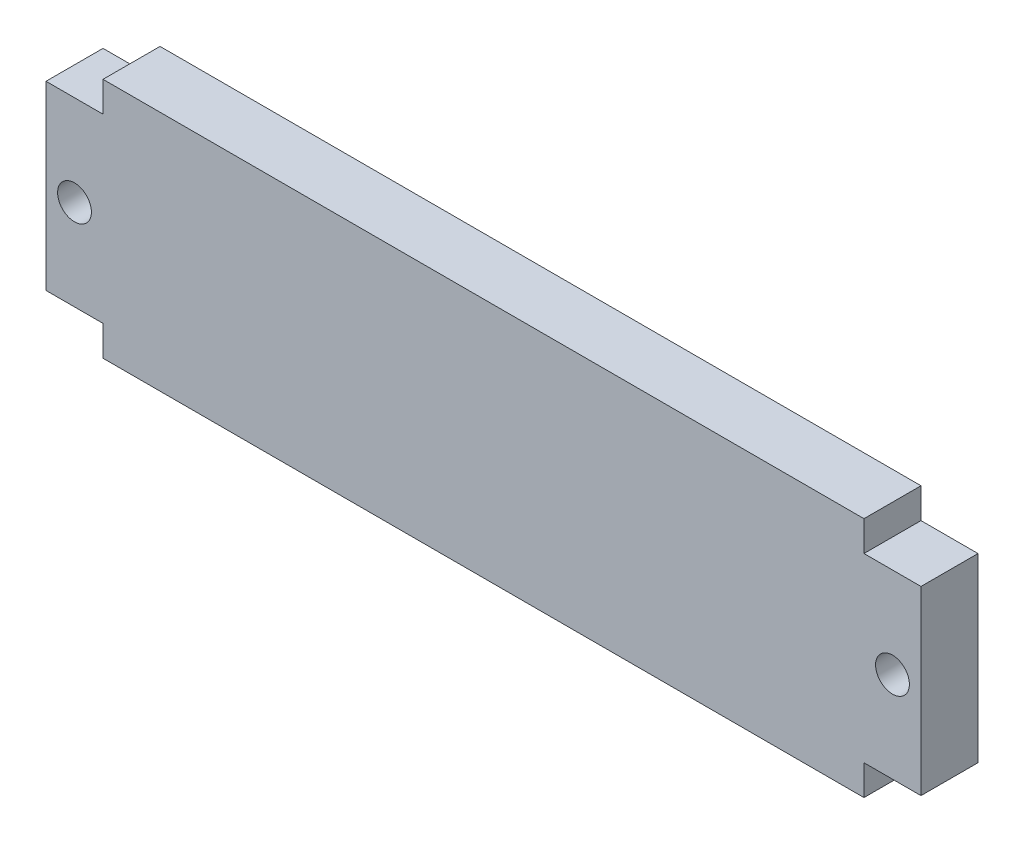
ISO-10303-21;
HEADER;
FILE_DESCRIPTION(('STEP AP214'),'2;1');
FILE_NAME('part.step','',(''),(''),'','','');
FILE_SCHEMA(('AUTOMOTIVE_DESIGN { 1 0 10303 214 1 1 1 1 }'));
ENDSEC;
DATA;
#1=APPLICATION_CONTEXT('core data for automotive mechanical design processes');
#2=APPLICATION_PROTOCOL_DEFINITION('international standard','automotive_design',2000,#1);
#3=PRODUCT_CONTEXT('',#1,'mechanical');
#4=PRODUCT('Part','Part','',(#3));
#5=PRODUCT_RELATED_PRODUCT_CATEGORY('part','',(#4));
#6=PRODUCT_DEFINITION_FORMATION('','',#4);
#7=PRODUCT_DEFINITION_CONTEXT('part definition',#1,'design');
#8=PRODUCT_DEFINITION('design','',#6,#7);
#9=PRODUCT_DEFINITION_SHAPE('','',#8);
#10=(LENGTH_UNIT() NAMED_UNIT(*) SI_UNIT(.MILLI.,.METRE.));
#11=(NAMED_UNIT(*) PLANE_ANGLE_UNIT() SI_UNIT($,.RADIAN.));
#12=(NAMED_UNIT(*) SI_UNIT($,.STERADIAN.) SOLID_ANGLE_UNIT());
#13=UNCERTAINTY_MEASURE_WITH_UNIT(LENGTH_MEASURE(1.E-05),#10,'distance_accuracy_value','');
#14=(GEOMETRIC_REPRESENTATION_CONTEXT(3) GLOBAL_UNCERTAINTY_ASSIGNED_CONTEXT((#13)) GLOBAL_UNIT_ASSIGNED_CONTEXT((#10,
#11,#12)) REPRESENTATION_CONTEXT('',''));
#15=CARTESIAN_POINT('',(0.,0.,0.));
#16=DIRECTION('',(0.,0.,1.));
#17=DIRECTION('',(1.,0.,0.));
#18=AXIS2_PLACEMENT_3D('',#15,#16,#17);
#19=CARTESIAN_POINT('',(0.,0.,-5.9944));
#20=DIRECTION('',(-1.,0.,0.));
#21=DIRECTION('',(0.,0.,1.));
#22=AXIS2_PLACEMENT_3D('',#19,#20,#21);
#23=PLANE('',#22);
#24=DIRECTION('',(0.,0.,1.));
#25=VECTOR('',#24,1.);
#26=CARTESIAN_POINT('',(0.,3.175,-5.9944));
#27=LINE('',#26,#25);
#28=CARTESIAN_POINT('',(0.,3.175,-5.9944));
#29=VERTEX_POINT('',#28);
#30=CARTESIAN_POINT('',(0.,3.175,0.));
#31=VERTEX_POINT('',#30);
#32=EDGE_CURVE('E211',#29,#31,#27,.T.);
#33=ORIENTED_EDGE('',*,*,#32,.T.);
#34=DIRECTION('',(0.,-1.,0.));
#35=VECTOR('',#34,1.);
#36=CARTESIAN_POINT('',(0.,0.,0.));
#37=LINE('',#36,#35);
#38=CARTESIAN_POINT('',(0.,22.225,0.));
#39=VERTEX_POINT('',#38);
#40=EDGE_CURVE('E158',#39,#31,#37,.T.);
#41=ORIENTED_EDGE('',*,*,#40,.F.);
#42=DIRECTION('',(0.,0.,1.));
#43=VECTOR('',#42,1.);
#44=CARTESIAN_POINT('',(0.,22.225,-5.9944));
#45=LINE('',#44,#43);
#46=CARTESIAN_POINT('',(0.,22.225,-5.9944));
#47=VERTEX_POINT('',#46);
#48=EDGE_CURVE('E181',#47,#39,#45,.T.);
#49=ORIENTED_EDGE('',*,*,#48,.F.);
#50=DIRECTION('',(0.,-1.,0.));
#51=VECTOR('',#50,1.);
#52=CARTESIAN_POINT('',(0.,0.,-5.9944));
#53=LINE('',#52,#51);
#54=EDGE_CURVE('E156',#47,#29,#53,.T.);
#55=ORIENTED_EDGE('',*,*,#54,.T.);
#56=EDGE_LOOP('',(#33,#41,#49,#55));
#57=FACE_BOUND('',#56,.T.);
#58=ADVANCED_FACE('F40',(#57),#23,.T.);
#59=CARTESIAN_POINT('',(0.,25.4,-5.9944));
#60=DIRECTION('',(0.,1.,0.));
#61=DIRECTION('',(0.,0.,1.));
#62=AXIS2_PLACEMENT_3D('',#59,#60,#61);
#63=PLANE('',#62);
#64=DIRECTION('',(0.,0.,1.));
#65=VECTOR('',#64,1.);
#66=CARTESIAN_POINT('',(86.0044,25.4,-5.9944));
#67=LINE('',#66,#65);
#68=CARTESIAN_POINT('',(86.0044,25.4,-5.9944));
#69=VERTEX_POINT('',#68);
#70=CARTESIAN_POINT('',(86.0044,25.4,0.));
#71=VERTEX_POINT('',#70);
#72=EDGE_CURVE('E56',#69,#71,#67,.T.);
#73=ORIENTED_EDGE('',*,*,#72,.F.);
#74=DIRECTION('',(-1.,0.,0.));
#75=VECTOR('',#74,1.);
#76=CARTESIAN_POINT('',(0.,25.4,-5.9944));
#77=LINE('',#76,#75);
#78=CARTESIAN_POINT('',(5.9944,25.4,-5.9944));
#79=VERTEX_POINT('',#78);
#80=EDGE_CURVE('E11',#69,#79,#77,.T.);
#81=ORIENTED_EDGE('',*,*,#80,.T.);
#82=DIRECTION('',(0.,0.,1.));
#83=VECTOR('',#82,1.);
#84=CARTESIAN_POINT('',(5.9944,25.4,-5.9944));
#85=LINE('',#84,#83);
#86=CARTESIAN_POINT('',(5.9944,25.4,0.));
#87=VERTEX_POINT('',#86);
#88=EDGE_CURVE('E173',#79,#87,#85,.T.);
#89=ORIENTED_EDGE('',*,*,#88,.T.);
#90=DIRECTION('',(-1.,0.,0.));
#91=VECTOR('',#90,1.);
#92=CARTESIAN_POINT('',(0.,25.4,0.));
#93=LINE('',#92,#91);
#94=EDGE_CURVE('E43',#71,#87,#93,.T.);
#95=ORIENTED_EDGE('',*,*,#94,.F.);
#96=EDGE_LOOP('',(#73,#81,#89,#95));
#97=FACE_BOUND('',#96,.T.);
#98=ADVANCED_FACE('F241',(#97),#63,.T.);
#99=CARTESIAN_POINT('',(91.9988,0.,-5.9944));
#100=DIRECTION('',(1.,0.,0.));
#101=DIRECTION('',(0.,0.,-1.));
#102=AXIS2_PLACEMENT_3D('',#99,#100,#101);
#103=PLANE('',#102);
#104=DIRECTION('',(0.,0.,1.));
#105=VECTOR('',#104,1.);
#106=CARTESIAN_POINT('',(91.9988,3.17499999999999,-5.9944));
#107=LINE('',#106,#105);
#108=CARTESIAN_POINT('',(91.9988,3.17499999999999,-5.9944));
#109=VERTEX_POINT('',#108);
#110=CARTESIAN_POINT('',(91.9988,3.17499999999999,0.));
#111=VERTEX_POINT('',#110);
#112=EDGE_CURVE('E64',#109,#111,#107,.T.);
#113=ORIENTED_EDGE('',*,*,#112,.F.);
#114=DIRECTION('',(0.,1.,0.));
#115=VECTOR('',#114,1.);
#116=CARTESIAN_POINT('',(91.9988,0.,-5.9944));
#117=LINE('',#116,#115);
#118=CARTESIAN_POINT('',(91.9988,22.225,-5.9944));
#119=VERTEX_POINT('',#118);
#120=EDGE_CURVE('E48',#109,#119,#117,.T.);
#121=ORIENTED_EDGE('',*,*,#120,.T.);
#122=DIRECTION('',(0.,0.,1.));
#123=VECTOR('',#122,1.);
#124=CARTESIAN_POINT('',(91.9988,22.225,-5.9944));
#125=LINE('',#124,#123);
#126=CARTESIAN_POINT('',(91.9988,22.225,0.));
#127=VERTEX_POINT('',#126);
#128=EDGE_CURVE('E135',#119,#127,#125,.T.);
#129=ORIENTED_EDGE('',*,*,#128,.T.);
#130=DIRECTION('',(0.,1.,0.));
#131=VECTOR('',#130,1.);
#132=CARTESIAN_POINT('',(91.9988,0.,0.));
#133=LINE('',#132,#131);
#134=EDGE_CURVE('E147',#111,#127,#133,.T.);
#135=ORIENTED_EDGE('',*,*,#134,.F.);
#136=EDGE_LOOP('',(#113,#121,#129,#135));
#137=FACE_BOUND('',#136,.T.);
#138=ADVANCED_FACE('F146',(#137),#103,.T.);
#139=CARTESIAN_POINT('',(0.,0.,-5.9944));
#140=DIRECTION('',(0.,-1.,0.));
#141=DIRECTION('',(0.,0.,-1.));
#142=AXIS2_PLACEMENT_3D('',#139,#140,#141);
#143=PLANE('',#142);
#144=DIRECTION('',(0.,0.,1.));
#145=VECTOR('',#144,1.);
#146=CARTESIAN_POINT('',(5.9944,0.,-5.9944));
#147=LINE('',#146,#145);
#148=CARTESIAN_POINT('',(5.9944,0.,-5.9944));
#149=VERTEX_POINT('',#148);
#150=CARTESIAN_POINT('',(5.9944,0.,0.));
#151=VERTEX_POINT('',#150);
#152=EDGE_CURVE('E205',#149,#151,#147,.T.);
#153=ORIENTED_EDGE('',*,*,#152,.F.);
#154=DIRECTION('',(1.,0.,0.));
#155=VECTOR('',#154,1.);
#156=CARTESIAN_POINT('',(0.,0.,-5.9944));
#157=LINE('',#156,#155);
#158=CARTESIAN_POINT('',(86.0044,0.,-5.9944));
#159=VERTEX_POINT('',#158);
#160=EDGE_CURVE('E164',#149,#159,#157,.T.);
#161=ORIENTED_EDGE('',*,*,#160,.T.);
#162=DIRECTION('',(0.,0.,1.));
#163=VECTOR('',#162,1.);
#164=CARTESIAN_POINT('',(86.0044,0.,-5.9944));
#165=LINE('',#164,#163);
#166=CARTESIAN_POINT('',(86.0044,0.,0.));
#167=VERTEX_POINT('',#166);
#168=EDGE_CURVE('E209',#159,#167,#165,.T.);
#169=ORIENTED_EDGE('',*,*,#168,.T.);
#170=DIRECTION('',(1.,0.,0.));
#171=VECTOR('',#170,1.);
#172=CARTESIAN_POINT('',(0.,0.,0.));
#173=LINE('',#172,#171);
#174=EDGE_CURVE('E154',#151,#167,#173,.T.);
#175=ORIENTED_EDGE('',*,*,#174,.F.);
#176=EDGE_LOOP('',(#153,#161,#169,#175));
#177=FACE_BOUND('',#176,.T.);
#178=ADVANCED_FACE('F267',(#177),#143,.T.);
#179=CARTESIAN_POINT('',(0.,0.,-5.9944));
#180=DIRECTION('',(0.,0.,-1.));
#181=DIRECTION('',(-1.,0.,0.));
#182=AXIS2_PLACEMENT_3D('',#179,#180,#181);
#183=PLANE('',#182);
#184=DIRECTION('',(-1.,0.,0.));
#185=VECTOR('',#184,1.);
#186=CARTESIAN_POINT('',(0.,3.175,-5.9944));
#187=LINE('',#186,#185);
#188=CARTESIAN_POINT('',(5.9944,3.175,-5.9944));
#189=VERTEX_POINT('',#188);
#190=EDGE_CURVE('E202',#189,#29,#187,.T.);
#191=ORIENTED_EDGE('',*,*,#190,.T.);
#192=ORIENTED_EDGE('',*,*,#54,.F.);
#193=DIRECTION('',(1.,0.,0.));
#194=VECTOR('',#193,1.);
#195=CARTESIAN_POINT('',(0.,22.225,-5.9944));
#196=LINE('',#195,#194);
#197=CARTESIAN_POINT('',(5.9944,22.225,-5.9944));
#198=VERTEX_POINT('',#197);
#199=EDGE_CURVE('E190',#47,#198,#196,.T.);
#200=ORIENTED_EDGE('',*,*,#199,.T.);
#201=DIRECTION('',(0.,1.,0.));
#202=VECTOR('',#201,1.);
#203=CARTESIAN_POINT('',(5.9944,25.4,-5.9944));
#204=LINE('',#203,#202);
#205=EDGE_CURVE('E184',#198,#79,#204,.T.);
#206=ORIENTED_EDGE('',*,*,#205,.T.);
#207=ORIENTED_EDGE('',*,*,#80,.F.);
#208=DIRECTION('',(0.,-1.,0.));
#209=VECTOR('',#208,1.);
#210=CARTESIAN_POINT('',(86.0044,25.4,-5.9944));
#211=LINE('',#210,#209);
#212=CARTESIAN_POINT('',(86.0044,22.225,-5.9944));
#213=VERTEX_POINT('',#212);
#214=EDGE_CURVE('E141',#69,#213,#211,.T.);
#215=ORIENTED_EDGE('',*,*,#214,.T.);
#216=DIRECTION('',(1.,0.,0.));
#217=VECTOR('',#216,1.);
#218=CARTESIAN_POINT('',(91.9988,22.225,-5.9944));
#219=LINE('',#218,#217);
#220=EDGE_CURVE('E233',#213,#119,#219,.T.);
#221=ORIENTED_EDGE('',*,*,#220,.T.);
#222=ORIENTED_EDGE('',*,*,#120,.F.);
#223=DIRECTION('',(-1.,0.,0.));
#224=VECTOR('',#223,1.);
#225=CARTESIAN_POINT('',(91.9988,3.17499999999999,-5.9944));
#226=LINE('',#225,#224);
#227=CARTESIAN_POINT('',(86.0044,3.17499999999999,-5.9944));
#228=VERTEX_POINT('',#227);
#229=EDGE_CURVE('E217',#109,#228,#226,.T.);
#230=ORIENTED_EDGE('',*,*,#229,.T.);
#231=DIRECTION('',(0.,-1.,0.));
#232=VECTOR('',#231,1.);
#233=CARTESIAN_POINT('',(86.0044,0.,-5.9944));
#234=LINE('',#233,#232);
#235=EDGE_CURVE('E221',#228,#159,#234,.T.);
#236=ORIENTED_EDGE('',*,*,#235,.T.);
#237=ORIENTED_EDGE('',*,*,#160,.F.);
#238=DIRECTION('',(0.,1.,0.));
#239=VECTOR('',#238,1.);
#240=CARTESIAN_POINT('',(5.9944,0.,-5.9944));
#241=LINE('',#240,#239);
#242=EDGE_CURVE('E198',#149,#189,#241,.T.);
#243=ORIENTED_EDGE('',*,*,#242,.T.);
#244=EDGE_LOOP('',(#191,#192,#200,#206,#207,#215,#221,#222,#230,#236,#237,#243));
#245=FACE_BOUND('',#244,.T.);
#246=CARTESIAN_POINT('',(2.9972,12.7,-5.9944));
#247=DIRECTION('',(0.,0.,1.));
#248=DIRECTION('',(1.,0.,0.));
#249=AXIS2_PLACEMENT_3D('',#246,#247,#248);
#250=CIRCLE('',#249,1.778);
#251=CARTESIAN_POINT('',(4.7752,12.7,-5.9944));
#252=VERTEX_POINT('',#251);
#253=EDGE_CURVE('E161',#252,#252,#250,.T.);
#254=ORIENTED_EDGE('',*,*,#253,.T.);
#255=EDGE_LOOP('',(#254));
#256=FACE_BOUND('',#255,.T.);
#257=CARTESIAN_POINT('',(89.0016,12.7,-5.9944));
#258=DIRECTION('',(0.,0.,1.));
#259=DIRECTION('',(-1.,0.,0.));
#260=AXIS2_PLACEMENT_3D('',#257,#258,#259);
#261=CIRCLE('',#260,1.77799999999998);
#262=CARTESIAN_POINT('',(87.2236,12.7,-5.9944));
#263=VERTEX_POINT('',#262);
#264=EDGE_CURVE('E169',#263,#263,#261,.T.);
#265=ORIENTED_EDGE('',*,*,#264,.T.);
#266=EDGE_LOOP('',(#265));
#267=FACE_BOUND('',#266,.T.);
#268=ADVANCED_FACE('F247',(#245,#256,#267),#183,.T.);
#269=CARTESIAN_POINT('',(0.,0.,0.));
#270=DIRECTION('',(0.,0.,-1.));
#271=DIRECTION('',(-1.,0.,0.));
#272=AXIS2_PLACEMENT_3D('',#269,#270,#271);
#273=PLANE('',#272);
#274=CARTESIAN_POINT('',(2.9972,12.7,0.));
#275=DIRECTION('',(0.,0.,1.));
#276=DIRECTION('',(1.,0.,0.));
#277=AXIS2_PLACEMENT_3D('',#274,#275,#276);
#278=CIRCLE('',#277,1.778);
#279=CARTESIAN_POINT('',(4.7752,12.7,0.));
#280=VERTEX_POINT('',#279);
#281=EDGE_CURVE('E176',#280,#280,#278,.T.);
#282=ORIENTED_EDGE('',*,*,#281,.F.);
#283=EDGE_LOOP('',(#282));
#284=FACE_BOUND('',#283,.T.);
#285=CARTESIAN_POINT('',(89.0016,12.7,0.));
#286=DIRECTION('',(0.,0.,1.));
#287=DIRECTION('',(-1.,0.,0.));
#288=AXIS2_PLACEMENT_3D('',#285,#286,#287);
#289=CIRCLE('',#288,1.77799999999998);
#290=CARTESIAN_POINT('',(87.2236,12.7,0.));
#291=VERTEX_POINT('',#290);
#292=EDGE_CURVE('E172',#291,#291,#289,.T.);
#293=ORIENTED_EDGE('',*,*,#292,.F.);
#294=EDGE_LOOP('',(#293));
#295=FACE_BOUND('',#294,.T.);
#296=ORIENTED_EDGE('',*,*,#40,.T.);
#297=DIRECTION('',(-1.,0.,0.));
#298=VECTOR('',#297,1.);
#299=CARTESIAN_POINT('',(0.,3.175,0.));
#300=LINE('',#299,#298);
#301=CARTESIAN_POINT('',(5.9944,3.175,0.));
#302=VERTEX_POINT('',#301);
#303=EDGE_CURVE('E201',#302,#31,#300,.T.);
#304=ORIENTED_EDGE('',*,*,#303,.F.);
#305=DIRECTION('',(0.,1.,0.));
#306=VECTOR('',#305,1.);
#307=CARTESIAN_POINT('',(5.9944,0.,0.));
#308=LINE('',#307,#306);
#309=EDGE_CURVE('E206',#151,#302,#308,.T.);
#310=ORIENTED_EDGE('',*,*,#309,.F.);
#311=ORIENTED_EDGE('',*,*,#174,.T.);
#312=DIRECTION('',(0.,-1.,0.));
#313=VECTOR('',#312,1.);
#314=CARTESIAN_POINT('',(86.0044,0.,0.));
#315=LINE('',#314,#313);
#316=CARTESIAN_POINT('',(86.0044,3.17499999999999,0.));
#317=VERTEX_POINT('',#316);
#318=EDGE_CURVE('E220',#317,#167,#315,.T.);
#319=ORIENTED_EDGE('',*,*,#318,.F.);
#320=DIRECTION('',(-1.,0.,0.));
#321=VECTOR('',#320,1.);
#322=CARTESIAN_POINT('',(91.9988,3.17499999999999,0.));
#323=LINE('',#322,#321);
#324=EDGE_CURVE('E149',#111,#317,#323,.T.);
#325=ORIENTED_EDGE('',*,*,#324,.F.);
#326=ORIENTED_EDGE('',*,*,#134,.T.);
#327=DIRECTION('',(1.,0.,0.));
#328=VECTOR('',#327,1.);
#329=CARTESIAN_POINT('',(91.9988,22.225,0.));
#330=LINE('',#329,#328);
#331=CARTESIAN_POINT('',(86.0044,22.225,0.));
#332=VERTEX_POINT('',#331);
#333=EDGE_CURVE('E131',#332,#127,#330,.T.);
#334=ORIENTED_EDGE('',*,*,#333,.F.);
#335=DIRECTION('',(0.,-1.,0.));
#336=VECTOR('',#335,1.);
#337=CARTESIAN_POINT('',(86.0044,25.4,0.));
#338=LINE('',#337,#336);
#339=EDGE_CURVE('E140',#71,#332,#338,.T.);
#340=ORIENTED_EDGE('',*,*,#339,.F.);
#341=ORIENTED_EDGE('',*,*,#94,.T.);
#342=DIRECTION('',(0.,1.,0.));
#343=VECTOR('',#342,1.);
#344=CARTESIAN_POINT('',(5.9944,25.4,0.));
#345=LINE('',#344,#343);
#346=CARTESIAN_POINT('',(5.9944,22.225,0.));
#347=VERTEX_POINT('',#346);
#348=EDGE_CURVE('E188',#347,#87,#345,.T.);
#349=ORIENTED_EDGE('',*,*,#348,.F.);
#350=DIRECTION('',(1.,0.,0.));
#351=VECTOR('',#350,1.);
#352=CARTESIAN_POINT('',(0.,22.225,0.));
#353=LINE('',#352,#351);
#354=EDGE_CURVE('E191',#39,#347,#353,.T.);
#355=ORIENTED_EDGE('',*,*,#354,.F.);
#356=EDGE_LOOP('',(#296,#304,#310,#311,#319,#325,#326,#334,#340,#341,#349,#355));
#357=FACE_BOUND('',#356,.T.);
#358=ADVANCED_FACE('F152',(#284,#295,#357),#273,.F.);
#359=CARTESIAN_POINT('',(89.0016,12.7,-5.9944));
#360=DIRECTION('',(0.,0.,1.));
#361=DIRECTION('',(1.,0.,0.));
#362=AXIS2_PLACEMENT_3D('',#359,#360,#361);
#363=CYLINDRICAL_SURFACE('',#362,1.77799999999998);
#364=ORIENTED_EDGE('',*,*,#264,.F.);
#365=EDGE_LOOP('',(#364));
#366=FACE_BOUND('',#365,.T.);
#367=ORIENTED_EDGE('',*,*,#292,.T.);
#368=EDGE_LOOP('',(#367));
#369=FACE_BOUND('',#368,.T.);
#370=ADVANCED_FACE('F299',(#366,#369),#363,.F.);
#371=CARTESIAN_POINT('',(2.9972,12.7,-5.9944));
#372=DIRECTION('',(0.,0.,1.));
#373=DIRECTION('',(1.,0.,0.));
#374=AXIS2_PLACEMENT_3D('',#371,#372,#373);
#375=CYLINDRICAL_SURFACE('',#374,1.778);
#376=ORIENTED_EDGE('',*,*,#253,.F.);
#377=EDGE_LOOP('',(#376));
#378=FACE_BOUND('',#377,.T.);
#379=ORIENTED_EDGE('',*,*,#281,.T.);
#380=EDGE_LOOP('',(#379));
#381=FACE_BOUND('',#380,.T.);
#382=ADVANCED_FACE('F304',(#378,#381),#375,.F.);
#383=CARTESIAN_POINT('',(5.9944,25.4,-5.9944));
#384=DIRECTION('',(1.,0.,0.));
#385=DIRECTION('',(0.,1.,0.));
#386=AXIS2_PLACEMENT_3D('',#383,#384,#385);
#387=PLANE('',#386);
#388=ORIENTED_EDGE('',*,*,#348,.T.);
#389=ORIENTED_EDGE('',*,*,#88,.F.);
#390=ORIENTED_EDGE('',*,*,#205,.F.);
#391=DIRECTION('',(0.,0.,1.));
#392=VECTOR('',#391,1.);
#393=CARTESIAN_POINT('',(5.9944,22.225,-5.9944));
#394=LINE('',#393,#392);
#395=EDGE_CURVE('E183',#198,#347,#394,.T.);
#396=ORIENTED_EDGE('',*,*,#395,.T.);
#397=EDGE_LOOP('',(#388,#389,#390,#396));
#398=FACE_BOUND('',#397,.T.);
#399=ADVANCED_FACE('F245',(#398),#387,.F.);
#400=CARTESIAN_POINT('',(0.,22.225,-5.9944));
#401=DIRECTION('',(0.,-1.,0.));
#402=DIRECTION('',(0.,0.,-1.));
#403=AXIS2_PLACEMENT_3D('',#400,#401,#402);
#404=PLANE('',#403);
#405=ORIENTED_EDGE('',*,*,#354,.T.);
#406=ORIENTED_EDGE('',*,*,#395,.F.);
#407=ORIENTED_EDGE('',*,*,#199,.F.);
#408=ORIENTED_EDGE('',*,*,#48,.T.);
#409=EDGE_LOOP('',(#405,#406,#407,#408));
#410=FACE_BOUND('',#409,.T.);
#411=ADVANCED_FACE('F252',(#410),#404,.F.);
#412=CARTESIAN_POINT('',(91.9988,22.225,-5.9944));
#413=DIRECTION('',(0.,-1.,0.));
#414=DIRECTION('',(0.,0.,-1.));
#415=AXIS2_PLACEMENT_3D('',#412,#413,#414);
#416=PLANE('',#415);
#417=ORIENTED_EDGE('',*,*,#333,.T.);
#418=ORIENTED_EDGE('',*,*,#128,.F.);
#419=ORIENTED_EDGE('',*,*,#220,.F.);
#420=DIRECTION('',(0.,0.,1.));
#421=VECTOR('',#420,1.);
#422=CARTESIAN_POINT('',(86.0044,22.225,-5.9944));
#423=LINE('',#422,#421);
#424=EDGE_CURVE('E137',#213,#332,#423,.T.);
#425=ORIENTED_EDGE('',*,*,#424,.T.);
#426=EDGE_LOOP('',(#417,#418,#419,#425));
#427=FACE_BOUND('',#426,.T.);
#428=ADVANCED_FACE('F133',(#427),#416,.F.);
#429=CARTESIAN_POINT('',(86.0044,25.4,-5.9944));
#430=DIRECTION('',(-1.,0.,0.));
#431=DIRECTION('',(0.,0.,1.));
#432=AXIS2_PLACEMENT_3D('',#429,#430,#431);
#433=PLANE('',#432);
#434=ORIENTED_EDGE('',*,*,#339,.T.);
#435=ORIENTED_EDGE('',*,*,#424,.F.);
#436=ORIENTED_EDGE('',*,*,#214,.F.);
#437=ORIENTED_EDGE('',*,*,#72,.T.);
#438=EDGE_LOOP('',(#434,#435,#436,#437));
#439=FACE_BOUND('',#438,.T.);
#440=ADVANCED_FACE('F237',(#439),#433,.F.);
#441=CARTESIAN_POINT('',(86.0044,0.,-5.9944));
#442=DIRECTION('',(-1.,0.,0.));
#443=DIRECTION('',(0.,0.,1.));
#444=AXIS2_PLACEMENT_3D('',#441,#442,#443);
#445=PLANE('',#444);
#446=ORIENTED_EDGE('',*,*,#318,.T.);
#447=ORIENTED_EDGE('',*,*,#168,.F.);
#448=ORIENTED_EDGE('',*,*,#235,.F.);
#449=DIRECTION('',(0.,0.,1.));
#450=VECTOR('',#449,1.);
#451=CARTESIAN_POINT('',(86.0044,3.17499999999999,-5.9944));
#452=LINE('',#451,#450);
#453=EDGE_CURVE('E228',#228,#317,#452,.T.);
#454=ORIENTED_EDGE('',*,*,#453,.T.);
#455=EDGE_LOOP('',(#446,#447,#448,#454));
#456=FACE_BOUND('',#455,.T.);
#457=ADVANCED_FACE('F270',(#456),#445,.F.);
#458=CARTESIAN_POINT('',(91.9988,3.17499999999999,-5.9944));
#459=DIRECTION('',(0.,1.,0.));
#460=DIRECTION('',(0.,0.,1.));
#461=AXIS2_PLACEMENT_3D('',#458,#459,#460);
#462=PLANE('',#461);
#463=ORIENTED_EDGE('',*,*,#324,.T.);
#464=ORIENTED_EDGE('',*,*,#453,.F.);
#465=ORIENTED_EDGE('',*,*,#229,.F.);
#466=ORIENTED_EDGE('',*,*,#112,.T.);
#467=EDGE_LOOP('',(#463,#464,#465,#466));
#468=FACE_BOUND('',#467,.T.);
#469=ADVANCED_FACE('F271',(#468),#462,.F.);
#470=CARTESIAN_POINT('',(0.,3.175,-5.9944));
#471=DIRECTION('',(0.,1.,0.));
#472=DIRECTION('',(0.,0.,1.));
#473=AXIS2_PLACEMENT_3D('',#470,#471,#472);
#474=PLANE('',#473);
#475=ORIENTED_EDGE('',*,*,#303,.T.);
#476=ORIENTED_EDGE('',*,*,#32,.F.);
#477=ORIENTED_EDGE('',*,*,#190,.F.);
#478=DIRECTION('',(0.,0.,1.));
#479=VECTOR('',#478,1.);
#480=CARTESIAN_POINT('',(5.9944,3.175,-5.9944));
#481=LINE('',#480,#479);
#482=EDGE_CURVE('E214',#189,#302,#481,.T.);
#483=ORIENTED_EDGE('',*,*,#482,.T.);
#484=EDGE_LOOP('',(#475,#476,#477,#483));
#485=FACE_BOUND('',#484,.T.);
#486=ADVANCED_FACE('F260',(#485),#474,.F.);
#487=CARTESIAN_POINT('',(5.9944,0.,-5.9944));
#488=DIRECTION('',(1.,0.,0.));
#489=DIRECTION('',(0.,1.,0.));
#490=AXIS2_PLACEMENT_3D('',#487,#488,#489);
#491=PLANE('',#490);
#492=ORIENTED_EDGE('',*,*,#309,.T.);
#493=ORIENTED_EDGE('',*,*,#482,.F.);
#494=ORIENTED_EDGE('',*,*,#242,.F.);
#495=ORIENTED_EDGE('',*,*,#152,.T.);
#496=EDGE_LOOP('',(#492,#493,#494,#495));
#497=FACE_BOUND('',#496,.T.);
#498=ADVANCED_FACE('F263',(#497),#491,.F.);
#499=CLOSED_SHELL('',(#58,#98,#138,#178,#268,#358,#370,#382,#399,#411,#428,#440,#457,#469,#486,#498));
#500=MANIFOLD_SOLID_BREP('B2',#499);
#501=ADVANCED_BREP_SHAPE_REPRESENTATION('',(#18,#500),#14);
#502=SHAPE_DEFINITION_REPRESENTATION(#9,#501);
ENDSEC;
END-ISO-10303-21;
